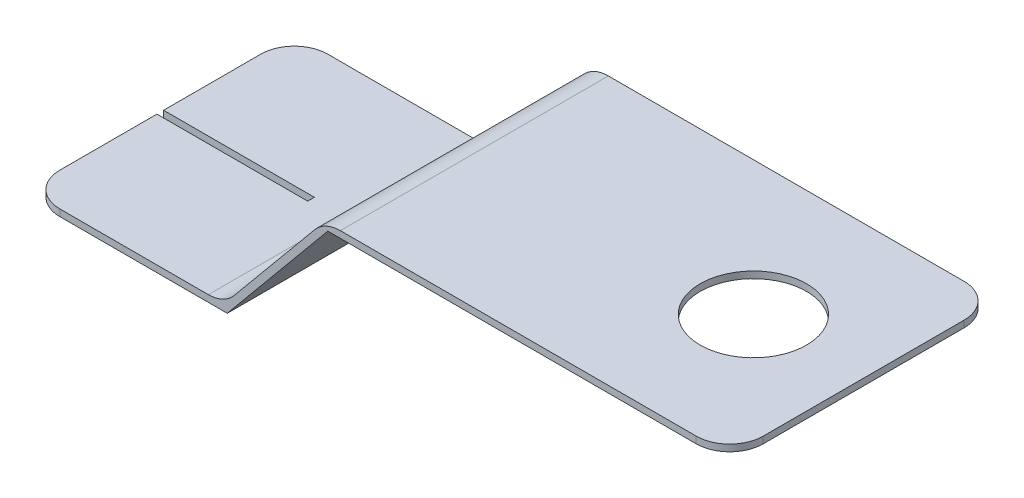
ISO-10303-21;
HEADER;
FILE_DESCRIPTION(('STEP AP214'),'2;1');
FILE_NAME('part.step','',(''),(''),'','','');
FILE_SCHEMA(('AUTOMOTIVE_DESIGN { 1 0 10303 214 1 1 1 1 }'));
ENDSEC;
DATA;
#1=APPLICATION_CONTEXT('core data for automotive mechanical design processes');
#2=APPLICATION_PROTOCOL_DEFINITION('international standard','automotive_design',2000,#1);
#3=PRODUCT_CONTEXT('',#1,'mechanical');
#4=PRODUCT('Part','Part','',(#3));
#5=PRODUCT_RELATED_PRODUCT_CATEGORY('part','',(#4));
#6=PRODUCT_DEFINITION_FORMATION('','',#4);
#7=PRODUCT_DEFINITION_CONTEXT('part definition',#1,'design');
#8=PRODUCT_DEFINITION('design','',#6,#7);
#9=PRODUCT_DEFINITION_SHAPE('','',#8);
#10=(LENGTH_UNIT() NAMED_UNIT(*) SI_UNIT(.MILLI.,.METRE.));
#11=(NAMED_UNIT(*) PLANE_ANGLE_UNIT() SI_UNIT($,.RADIAN.));
#12=(NAMED_UNIT(*) SI_UNIT($,.STERADIAN.) SOLID_ANGLE_UNIT());
#13=UNCERTAINTY_MEASURE_WITH_UNIT(LENGTH_MEASURE(1.E-05),#10,'distance_accuracy_value','');
#14=(GEOMETRIC_REPRESENTATION_CONTEXT(3) GLOBAL_UNCERTAINTY_ASSIGNED_CONTEXT((#13)) GLOBAL_UNIT_ASSIGNED_CONTEXT((#10,
#11,#12)) REPRESENTATION_CONTEXT('',''));
#15=CARTESIAN_POINT('',(0.,0.,0.));
#16=DIRECTION('',(0.,0.,1.));
#17=DIRECTION('',(1.,0.,0.));
#18=AXIS2_PLACEMENT_3D('',#15,#16,#17);
#19=CARTESIAN_POINT('',(0.,0.2,4.));
#20=DIRECTION('',(1.,0.,0.));
#21=DIRECTION('',(0.,0.,-1.));
#22=AXIS2_PLACEMENT_3D('',#19,#20,#21);
#23=PLANE('',#22);
#24=DIRECTION('',(0.,0.,-1.));
#25=VECTOR('',#24,1.);
#26=CARTESIAN_POINT('',(0.,0.,4.));
#27=LINE('',#26,#25);
#28=CARTESIAN_POINT('',(0.,0.,-0.1));
#29=VERTEX_POINT('',#28);
#30=CARTESIAN_POINT('',(0.,0.,-3.));
#31=VERTEX_POINT('',#30);
#32=EDGE_CURVE('E287',#29,#31,#27,.T.);
#33=ORIENTED_EDGE('',*,*,#32,.F.);
#34=DIRECTION('',(0.,1.,0.));
#35=VECTOR('',#34,1.);
#36=CARTESIAN_POINT('',(0.,-9.8,-0.1));
#37=LINE('',#36,#35);
#38=CARTESIAN_POINT('',(0.,0.2,-0.1));
#39=VERTEX_POINT('',#38);
#40=EDGE_CURVE('E202',#29,#39,#37,.T.);
#41=ORIENTED_EDGE('',*,*,#40,.T.);
#42=DIRECTION('',(0.,0.,-1.));
#43=VECTOR('',#42,1.);
#44=CARTESIAN_POINT('',(0.,0.2,4.));
#45=LINE('',#44,#43);
#46=CARTESIAN_POINT('',(0.,0.2,-3.));
#47=VERTEX_POINT('',#46);
#48=EDGE_CURVE('E249',#39,#47,#45,.T.);
#49=ORIENTED_EDGE('',*,*,#48,.T.);
#50=DIRECTION('',(0.,-1.,0.));
#51=VECTOR('',#50,1.);
#52=CARTESIAN_POINT('',(0.,0.2,-3.));
#53=LINE('',#52,#51);
#54=EDGE_CURVE('E329',#47,#31,#53,.T.);
#55=ORIENTED_EDGE('',*,*,#54,.T.);
#56=EDGE_LOOP('',(#33,#41,#49,#55));
#57=FACE_BOUND('',#56,.T.);
#58=ADVANCED_FACE('F42',(#57),#23,.F.);
#59=CARTESIAN_POINT('',(0.,0.2,3.));
#60=VERTEX_POINT('',#59);
#61=CARTESIAN_POINT('',(0.,0.2,0.1));
#62=VERTEX_POINT('',#61);
#63=EDGE_CURVE('E268',#60,#62,#45,.T.);
#64=ORIENTED_EDGE('',*,*,#63,.T.);
#65=DIRECTION('',(0.,1.,0.));
#66=VECTOR('',#65,1.);
#67=CARTESIAN_POINT('',(0.,-9.8,0.1));
#68=LINE('',#67,#66);
#69=CARTESIAN_POINT('',(0.,0.,0.1));
#70=VERTEX_POINT('',#69);
#71=EDGE_CURVE('E182',#70,#62,#68,.T.);
#72=ORIENTED_EDGE('',*,*,#71,.F.);
#73=CARTESIAN_POINT('',(0.,0.,3.));
#74=VERTEX_POINT('',#73);
#75=EDGE_CURVE('E288',#74,#70,#27,.T.);
#76=ORIENTED_EDGE('',*,*,#75,.F.);
#77=DIRECTION('',(0.,-1.,0.));
#78=VECTOR('',#77,1.);
#79=CARTESIAN_POINT('',(0.,0.2,3.));
#80=LINE('',#79,#78);
#81=EDGE_CURVE('E326',#74,#60,#80,.F.);
#82=ORIENTED_EDGE('',*,*,#81,.T.);
#83=EDGE_LOOP('',(#64,#72,#76,#82));
#84=FACE_BOUND('',#83,.T.);
#85=ADVANCED_FACE('F423',(#84),#23,.F.);
#86=CARTESIAN_POINT('',(0.,0.,4.));
#87=DIRECTION('',(0.,1.,0.));
#88=DIRECTION('',(0.,0.,1.));
#89=AXIS2_PLACEMENT_3D('',#86,#87,#88);
#90=PLANE('',#89);
#91=DIRECTION('',(0.,0.,-1.));
#92=VECTOR('',#91,1.);
#93=CARTESIAN_POINT('',(4.5,0.,4.));
#94=LINE('',#93,#92);
#95=CARTESIAN_POINT('',(4.5,0.,0.0999999999999999));
#96=VERTEX_POINT('',#95);
#97=CARTESIAN_POINT('',(4.5,0.,-0.1));
#98=VERTEX_POINT('',#97);
#99=EDGE_CURVE('E177',#96,#98,#94,.T.);
#100=ORIENTED_EDGE('',*,*,#99,.T.);
#101=DIRECTION('',(-1.,0.,0.));
#102=VECTOR('',#101,1.);
#103=CARTESIAN_POINT('',(0.,0.,-0.1));
#104=LINE('',#103,#102);
#105=EDGE_CURVE('E215',#98,#29,#104,.T.);
#106=ORIENTED_EDGE('',*,*,#105,.T.);
#107=ORIENTED_EDGE('',*,*,#32,.T.);
#108=CARTESIAN_POINT('',(1.,0.,-3.));
#109=DIRECTION('',(0.,1.,0.));
#110=DIRECTION('',(0.,0.,1.));
#111=AXIS2_PLACEMENT_3D('',#108,#109,#110);
#112=CIRCLE('',#111,1.);
#113=CARTESIAN_POINT('',(1.,0.,-4.));
#114=VERTEX_POINT('',#113);
#115=EDGE_CURVE('E336',#31,#114,#112,.F.);
#116=ORIENTED_EDGE('',*,*,#115,.T.);
#117=DIRECTION('',(1.,0.,0.));
#118=VECTOR('',#117,1.);
#119=CARTESIAN_POINT('',(0.,0.,-4.));
#120=LINE('',#119,#118);
#121=CARTESIAN_POINT('',(6.,0.,-4.));
#122=VERTEX_POINT('',#121);
#123=EDGE_CURVE('E227',#114,#122,#120,.T.);
#124=ORIENTED_EDGE('',*,*,#123,.T.);
#125=DIRECTION('',(0.,0.,-1.));
#126=VECTOR('',#125,1.);
#127=CARTESIAN_POINT('',(6.,0.,4.));
#128=LINE('',#127,#126);
#129=CARTESIAN_POINT('',(6.,0.,4.));
#130=VERTEX_POINT('',#129);
#131=EDGE_CURVE('E283',#130,#122,#128,.T.);
#132=ORIENTED_EDGE('',*,*,#131,.F.);
#133=DIRECTION('',(1.,0.,0.));
#134=VECTOR('',#133,1.);
#135=CARTESIAN_POINT('',(0.,0.,4.));
#136=LINE('',#135,#134);
#137=CARTESIAN_POINT('',(1.,0.,4.));
#138=VERTEX_POINT('',#137);
#139=EDGE_CURVE('E228',#138,#130,#136,.T.);
#140=ORIENTED_EDGE('',*,*,#139,.F.);
#141=CARTESIAN_POINT('',(1.,0.,3.));
#142=DIRECTION('',(0.,1.,0.));
#143=DIRECTION('',(0.,0.,1.));
#144=AXIS2_PLACEMENT_3D('',#141,#142,#143);
#145=CIRCLE('',#144,1.);
#146=EDGE_CURVE('E333',#138,#74,#145,.F.);
#147=ORIENTED_EDGE('',*,*,#146,.T.);
#148=ORIENTED_EDGE('',*,*,#75,.T.);
#149=DIRECTION('',(1.,0.,0.));
#150=VECTOR('',#149,1.);
#151=CARTESIAN_POINT('',(0.,0.,0.1));
#152=LINE('',#151,#150);
#153=EDGE_CURVE('E206',#70,#96,#152,.T.);
#154=ORIENTED_EDGE('',*,*,#153,.T.);
#155=EDGE_LOOP('',(#100,#106,#107,#116,#124,#132,#140,#147,#148,#154));
#156=FACE_BOUND('',#155,.T.);
#157=ADVANCED_FACE('F386',(#156),#90,.F.);
#158=CARTESIAN_POINT('',(6.,0.,4.));
#159=DIRECTION('',(-0.77039432112469,0.637567714034226,0.));
#160=DIRECTION('',(-0.637567714034226,-0.77039432112469,0.));
#161=AXIS2_PLACEMENT_3D('',#158,#159,#160);
#162=PLANE('',#161);
#163=DIRECTION('',(0.637567714034226,0.77039432112469,0.));
#164=VECTOR('',#163,1.);
#165=CARTESIAN_POINT('',(6.,0.,-4.));
#166=LINE('',#165,#164);
#167=CARTESIAN_POINT('',(9.,3.625,-4.));
#168=VERTEX_POINT('',#167);
#169=EDGE_CURVE('E252',#122,#168,#166,.T.);
#170=ORIENTED_EDGE('',*,*,#169,.T.);
#171=DIRECTION('',(0.,0.,-1.));
#172=VECTOR('',#171,1.);
#173=CARTESIAN_POINT('',(9.,3.625,4.));
#174=LINE('',#173,#172);
#175=CARTESIAN_POINT('',(9.,3.625,4.));
#176=VERTEX_POINT('',#175);
#177=EDGE_CURVE('E279',#176,#168,#174,.T.);
#178=ORIENTED_EDGE('',*,*,#177,.F.);
#179=DIRECTION('',(0.637567714034226,0.77039432112469,0.));
#180=VECTOR('',#179,1.);
#181=CARTESIAN_POINT('',(6.,0.,4.));
#182=LINE('',#181,#180);
#183=EDGE_CURVE('E231',#130,#176,#182,.T.);
#184=ORIENTED_EDGE('',*,*,#183,.F.);
#185=ORIENTED_EDGE('',*,*,#131,.T.);
#186=EDGE_LOOP('',(#170,#178,#184,#185));
#187=FACE_BOUND('',#186,.T.);
#188=ADVANCED_FACE('F393',(#187),#162,.F.);
#189=CARTESIAN_POINT('',(9.,3.625,4.));
#190=DIRECTION('',(0.,1.,0.));
#191=DIRECTION('',(-1.,0.,0.));
#192=AXIS2_PLACEMENT_3D('',#189,#190,#191);
#193=PLANE('',#192);
#194=CARTESIAN_POINT('',(17.7059099279349,3.625,0.));
#195=DIRECTION('',(0.,1.,0.));
#196=DIRECTION('',(-1.,0.,0.));
#197=AXIS2_PLACEMENT_3D('',#194,#195,#196);
#198=CIRCLE('',#197,1.5875);
#199=CARTESIAN_POINT('',(16.1184099279349,3.625,0.));
#200=VERTEX_POINT('',#199);
#201=EDGE_CURVE('E223',#200,#200,#198,.T.);
#202=ORIENTED_EDGE('',*,*,#201,.T.);
#203=EDGE_LOOP('',(#202));
#204=FACE_BOUND('',#203,.T.);
#205=DIRECTION('',(1.,0.,0.));
#206=VECTOR('',#205,1.);
#207=CARTESIAN_POINT('',(9.,3.625,-4.));
#208=LINE('',#207,#206);
#209=CARTESIAN_POINT('',(20.,3.625,-4.));
#210=VERTEX_POINT('',#209);
#211=EDGE_CURVE('E255',#168,#210,#208,.T.);
#212=ORIENTED_EDGE('',*,*,#211,.T.);
#213=CARTESIAN_POINT('',(20.,3.625,-3.));
#214=DIRECTION('',(0.,1.,0.));
#215=DIRECTION('',(-1.,0.,0.));
#216=AXIS2_PLACEMENT_3D('',#213,#214,#215);
#217=CIRCLE('',#216,1.);
#218=CARTESIAN_POINT('',(21.,3.625,-3.));
#219=VERTEX_POINT('',#218);
#220=EDGE_CURVE('E315',#210,#219,#217,.F.);
#221=ORIENTED_EDGE('',*,*,#220,.T.);
#222=DIRECTION('',(0.,0.,-1.));
#223=VECTOR('',#222,1.);
#224=CARTESIAN_POINT('',(21.,3.625,4.));
#225=LINE('',#224,#223);
#226=CARTESIAN_POINT('',(21.,3.625,3.));
#227=VERTEX_POINT('',#226);
#228=EDGE_CURVE('E275',#227,#219,#225,.T.);
#229=ORIENTED_EDGE('',*,*,#228,.F.);
#230=CARTESIAN_POINT('',(20.,3.625,3.));
#231=DIRECTION('',(0.,1.,0.));
#232=DIRECTION('',(-1.,0.,0.));
#233=AXIS2_PLACEMENT_3D('',#230,#231,#232);
#234=CIRCLE('',#233,1.);
#235=CARTESIAN_POINT('',(20.,3.625,4.));
#236=VERTEX_POINT('',#235);
#237=EDGE_CURVE('E312',#227,#236,#234,.F.);
#238=ORIENTED_EDGE('',*,*,#237,.T.);
#239=DIRECTION('',(1.,0.,0.));
#240=VECTOR('',#239,1.);
#241=CARTESIAN_POINT('',(9.,3.625,4.));
#242=LINE('',#241,#240);
#243=EDGE_CURVE('E235',#176,#236,#242,.T.);
#244=ORIENTED_EDGE('',*,*,#243,.F.);
#245=ORIENTED_EDGE('',*,*,#177,.T.);
#246=EDGE_LOOP('',(#212,#221,#229,#238,#244,#245));
#247=FACE_BOUND('',#246,.T.);
#248=ADVANCED_FACE('F412',(#204,#247),#193,.F.);
#249=CARTESIAN_POINT('',(21.,3.825,4.));
#250=DIRECTION('',(-1.,0.,0.));
#251=DIRECTION('',(0.,0.,1.));
#252=AXIS2_PLACEMENT_3D('',#249,#250,#251);
#253=PLANE('',#252);
#254=ORIENTED_EDGE('',*,*,#228,.T.);
#255=DIRECTION('',(0.,1.,0.));
#256=VECTOR('',#255,1.);
#257=CARTESIAN_POINT('',(21.,3.825,-3.));
#258=LINE('',#257,#256);
#259=CARTESIAN_POINT('',(21.,3.825,-3.));
#260=VERTEX_POINT('',#259);
#261=EDGE_CURVE('E295',#219,#260,#258,.T.);
#262=ORIENTED_EDGE('',*,*,#261,.T.);
#263=DIRECTION('',(0.,0.,-1.));
#264=VECTOR('',#263,1.);
#265=CARTESIAN_POINT('',(21.,3.825,4.));
#266=LINE('',#265,#264);
#267=CARTESIAN_POINT('',(21.,3.825,3.));
#268=VERTEX_POINT('',#267);
#269=EDGE_CURVE('E271',#268,#260,#266,.T.);
#270=ORIENTED_EDGE('',*,*,#269,.F.);
#271=DIRECTION('',(0.,1.,0.));
#272=VECTOR('',#271,1.);
#273=CARTESIAN_POINT('',(21.,3.625,3.));
#274=LINE('',#273,#272);
#275=EDGE_CURVE('E292',#268,#227,#274,.F.);
#276=ORIENTED_EDGE('',*,*,#275,.T.);
#277=EDGE_LOOP('',(#254,#262,#270,#276));
#278=FACE_BOUND('',#277,.T.);
#279=ADVANCED_FACE('F404',(#278),#253,.F.);
#280=CARTESIAN_POINT('',(8.90590992793492,3.825,4.));
#281=DIRECTION('',(0.,-1.,0.));
#282=DIRECTION('',(0.,0.,-1.));
#283=AXIS2_PLACEMENT_3D('',#280,#281,#282);
#284=PLANE('',#283);
#285=CARTESIAN_POINT('',(17.7059099279349,3.825,0.));
#286=DIRECTION('',(0.,1.,0.));
#287=DIRECTION('',(0.,0.,1.));
#288=AXIS2_PLACEMENT_3D('',#285,#286,#287);
#289=CIRCLE('',#288,1.5875);
#290=CARTESIAN_POINT('',(17.7059099279349,3.825,1.5875));
#291=VERTEX_POINT('',#290);
#292=EDGE_CURVE('E219',#291,#291,#289,.T.);
#293=ORIENTED_EDGE('',*,*,#292,.F.);
#294=EDGE_LOOP('',(#293));
#295=FACE_BOUND('',#294,.T.);
#296=DIRECTION('',(-1.,0.,0.));
#297=VECTOR('',#296,1.);
#298=CARTESIAN_POINT('',(8.90590992793492,3.825,-4.));
#299=LINE('',#298,#297);
#300=CARTESIAN_POINT('',(20.,3.825,-4.));
#301=VERTEX_POINT('',#300);
#302=CARTESIAN_POINT('',(9.37636028826035,3.825,-4.));
#303=VERTEX_POINT('',#302);
#304=EDGE_CURVE('E259',#301,#303,#299,.T.);
#305=ORIENTED_EDGE('',*,*,#304,.T.);
#306=DIRECTION('',(0.,0.,-1.));
#307=VECTOR('',#306,1.);
#308=CARTESIAN_POINT('',(9.37636028826035,3.825,4.));
#309=LINE('',#308,#307);
#310=CARTESIAN_POINT('',(9.37636028826035,3.825,4.));
#311=VERTEX_POINT('',#310);
#312=EDGE_CURVE('E58',#303,#311,#309,.F.);
#313=ORIENTED_EDGE('',*,*,#312,.T.);
#314=DIRECTION('',(-1.,0.,0.));
#315=VECTOR('',#314,1.);
#316=CARTESIAN_POINT('',(8.90590992793492,3.825,4.));
#317=LINE('',#316,#315);
#318=CARTESIAN_POINT('',(20.,3.825,4.));
#319=VERTEX_POINT('',#318);
#320=EDGE_CURVE('E239',#319,#311,#317,.T.);
#321=ORIENTED_EDGE('',*,*,#320,.F.);
#322=CARTESIAN_POINT('',(20.,3.825,3.));
#323=DIRECTION('',(0.,-1.,0.));
#324=DIRECTION('',(0.,0.,-1.));
#325=AXIS2_PLACEMENT_3D('',#322,#323,#324);
#326=CIRCLE('',#325,1.);
#327=EDGE_CURVE('E299',#319,#268,#326,.F.);
#328=ORIENTED_EDGE('',*,*,#327,.T.);
#329=ORIENTED_EDGE('',*,*,#269,.T.);
#330=CARTESIAN_POINT('',(20.,3.825,-3.));
#331=DIRECTION('',(0.,-1.,0.));
#332=DIRECTION('',(0.,0.,-1.));
#333=AXIS2_PLACEMENT_3D('',#330,#331,#332);
#334=CIRCLE('',#333,1.);
#335=EDGE_CURVE('E302',#260,#301,#334,.F.);
#336=ORIENTED_EDGE('',*,*,#335,.T.);
#337=EDGE_LOOP('',(#305,#313,#321,#328,#329,#336));
#338=FACE_BOUND('',#337,.T.);
#339=ADVANCED_FACE('F402',(#295,#338),#284,.F.);
#340=CARTESIAN_POINT('',(5.90590992793492,0.2,4.));
#341=DIRECTION('',(0.770394321124689,-0.637567714034226,0.));
#342=DIRECTION('',(0.637567714034226,0.770394321124689,0.));
#343=AXIS2_PLACEMENT_3D('',#340,#341,#342);
#344=PLANE('',#343);
#345=DIRECTION('',(-0.637567714034226,-0.770394321124689,0.));
#346=VECTOR('',#345,1.);
#347=CARTESIAN_POINT('',(5.90590992793492,0.2,-4.));
#348=LINE('',#347,#346);
#349=CARTESIAN_POINT('',(8.60596596713566,3.46256771403423,-4.));
#350=VERTEX_POINT('',#349);
#351=CARTESIAN_POINT('',(6.20585388873418,0.562432285965774,-4.));
#352=VERTEX_POINT('',#351);
#353=EDGE_CURVE('E262',#350,#352,#348,.T.);
#354=ORIENTED_EDGE('',*,*,#353,.T.);
#355=DIRECTION('',(0.,0.,-1.));
#356=VECTOR('',#355,1.);
#357=CARTESIAN_POINT('',(6.20585388873418,0.562432285965774,4.));
#358=LINE('',#357,#356);
#359=CARTESIAN_POINT('',(6.20585388873418,0.562432285965774,4.));
#360=VERTEX_POINT('',#359);
#361=EDGE_CURVE('E355',#352,#360,#358,.F.);
#362=ORIENTED_EDGE('',*,*,#361,.T.);
#363=DIRECTION('',(-0.637567714034226,-0.770394321124689,0.));
#364=VECTOR('',#363,1.);
#365=CARTESIAN_POINT('',(5.90590992793492,0.2,4.));
#366=LINE('',#365,#364);
#367=CARTESIAN_POINT('',(8.60596596713566,3.46256771403423,4.));
#368=VERTEX_POINT('',#367);
#369=EDGE_CURVE('E242',#368,#360,#366,.T.);
#370=ORIENTED_EDGE('',*,*,#369,.F.);
#371=DIRECTION('',(0.,0.,-1.));
#372=VECTOR('',#371,1.);
#373=CARTESIAN_POINT('',(8.60596596713566,3.46256771403423,4.));
#374=LINE('',#373,#372);
#375=EDGE_CURVE('E351',#368,#350,#374,.T.);
#376=ORIENTED_EDGE('',*,*,#375,.T.);
#377=EDGE_LOOP('',(#354,#362,#370,#376));
#378=FACE_BOUND('',#377,.T.);
#379=ADVANCED_FACE('F371',(#378),#344,.F.);
#380=CARTESIAN_POINT('',(0.,0.2,4.));
#381=DIRECTION('',(0.,-1.,0.));
#382=DIRECTION('',(1.,0.,0.));
#383=AXIS2_PLACEMENT_3D('',#380,#381,#382);
#384=PLANE('',#383);
#385=DIRECTION('',(-1.,0.,0.));
#386=VECTOR('',#385,1.);
#387=CARTESIAN_POINT('',(0.,0.2,4.));
#388=LINE('',#387,#386);
#389=CARTESIAN_POINT('',(5.43545956760949,0.2,4.));
#390=VERTEX_POINT('',#389);
#391=CARTESIAN_POINT('',(1.,0.2,4.));
#392=VERTEX_POINT('',#391);
#393=EDGE_CURVE('E246',#390,#392,#388,.T.);
#394=ORIENTED_EDGE('',*,*,#393,.F.);
#395=DIRECTION('',(0.,0.,-1.));
#396=VECTOR('',#395,1.);
#397=CARTESIAN_POINT('',(5.43545956760949,0.2,-4.));
#398=LINE('',#397,#396);
#399=CARTESIAN_POINT('',(5.43545956760949,0.2,-4.));
#400=VERTEX_POINT('',#399);
#401=EDGE_CURVE('E347',#390,#400,#398,.T.);
#402=ORIENTED_EDGE('',*,*,#401,.T.);
#403=DIRECTION('',(-1.,0.,0.));
#404=VECTOR('',#403,1.);
#405=CARTESIAN_POINT('',(0.,0.2,-4.));
#406=LINE('',#405,#404);
#407=CARTESIAN_POINT('',(1.,0.2,-4.));
#408=VERTEX_POINT('',#407);
#409=EDGE_CURVE('E232',#400,#408,#406,.T.);
#410=ORIENTED_EDGE('',*,*,#409,.T.);
#411=CARTESIAN_POINT('',(1.,0.2,-3.));
#412=DIRECTION('',(0.,-1.,0.));
#413=DIRECTION('',(1.,0.,0.));
#414=AXIS2_PLACEMENT_3D('',#411,#412,#413);
#415=CIRCLE('',#414,1.);
#416=EDGE_CURVE('E343',#408,#47,#415,.F.);
#417=ORIENTED_EDGE('',*,*,#416,.T.);
#418=ORIENTED_EDGE('',*,*,#48,.F.);
#419=DIRECTION('',(-1.,0.,0.));
#420=VECTOR('',#419,1.);
#421=CARTESIAN_POINT('',(0.,0.2,-0.1));
#422=LINE('',#421,#420);
#423=CARTESIAN_POINT('',(4.5,0.2,-0.1));
#424=VERTEX_POINT('',#423);
#425=EDGE_CURVE('E196',#424,#39,#422,.T.);
#426=ORIENTED_EDGE('',*,*,#425,.F.);
#427=DIRECTION('',(0.,0.,-1.));
#428=VECTOR('',#427,1.);
#429=CARTESIAN_POINT('',(4.5,0.2,-0.1));
#430=LINE('',#429,#428);
#431=CARTESIAN_POINT('',(4.5,0.2,0.0999999999999999));
#432=VERTEX_POINT('',#431);
#433=EDGE_CURVE('E174',#432,#424,#430,.T.);
#434=ORIENTED_EDGE('',*,*,#433,.F.);
#435=DIRECTION('',(1.,0.,0.));
#436=VECTOR('',#435,1.);
#437=CARTESIAN_POINT('',(0.,0.2,0.1));
#438=LINE('',#437,#436);
#439=EDGE_CURVE('E185',#62,#432,#438,.T.);
#440=ORIENTED_EDGE('',*,*,#439,.F.);
#441=ORIENTED_EDGE('',*,*,#63,.F.);
#442=CARTESIAN_POINT('',(1.,0.2,3.));
#443=DIRECTION('',(0.,-1.,0.));
#444=DIRECTION('',(1.,0.,0.));
#445=AXIS2_PLACEMENT_3D('',#442,#443,#444);
#446=CIRCLE('',#445,1.);
#447=EDGE_CURVE('E339',#60,#392,#446,.F.);
#448=ORIENTED_EDGE('',*,*,#447,.T.);
#449=EDGE_LOOP('',(#394,#402,#410,#417,#418,#426,#434,#440,#441,#448));
#450=FACE_BOUND('',#449,.T.);
#451=ADVANCED_FACE('F194',(#450),#384,.F.);
#452=CARTESIAN_POINT('',(0.,0.,4.));
#453=DIRECTION('',(0.,0.,1.));
#454=DIRECTION('',(1.,0.,0.));
#455=AXIS2_PLACEMENT_3D('',#452,#453,#454);
#456=PLANE('',#455);
#457=ORIENTED_EDGE('',*,*,#320,.T.);
#458=CARTESIAN_POINT('',(9.37636028826035,2.825,4.));
#459=DIRECTION('',(0.,0.,1.));
#460=DIRECTION('',(1.,0.,0.));
#461=AXIS2_PLACEMENT_3D('',#458,#459,#460);
#462=CIRCLE('',#461,1.);
#463=EDGE_CURVE('E362',#311,#368,#462,.T.);
#464=ORIENTED_EDGE('',*,*,#463,.T.);
#465=ORIENTED_EDGE('',*,*,#369,.T.);
#466=CARTESIAN_POINT('',(5.43545956760949,1.2,4.));
#467=DIRECTION('',(0.,0.,1.));
#468=DIRECTION('',(1.,0.,0.));
#469=AXIS2_PLACEMENT_3D('',#466,#467,#468);
#470=CIRCLE('',#469,1.);
#471=EDGE_CURVE('E11',#360,#390,#470,.F.);
#472=ORIENTED_EDGE('',*,*,#471,.T.);
#473=ORIENTED_EDGE('',*,*,#393,.T.);
#474=DIRECTION('',(0.,-1.,0.));
#475=VECTOR('',#474,1.);
#476=CARTESIAN_POINT('',(1.,0.,4.));
#477=LINE('',#476,#475);
#478=EDGE_CURVE('E318',#392,#138,#477,.T.);
#479=ORIENTED_EDGE('',*,*,#478,.T.);
#480=ORIENTED_EDGE('',*,*,#139,.T.);
#481=ORIENTED_EDGE('',*,*,#183,.T.);
#482=ORIENTED_EDGE('',*,*,#243,.T.);
#483=DIRECTION('',(0.,1.,0.));
#484=VECTOR('',#483,1.);
#485=CARTESIAN_POINT('',(20.,3.825,4.));
#486=LINE('',#485,#484);
#487=EDGE_CURVE('E322',#236,#319,#486,.T.);
#488=ORIENTED_EDGE('',*,*,#487,.T.);
#489=EDGE_LOOP('',(#457,#464,#465,#472,#473,#479,#480,#481,#482,#488));
#490=FACE_BOUND('',#489,.T.);
#491=ADVANCED_FACE('F377',(#490),#456,.T.);
#492=CARTESIAN_POINT('',(0.,0.,-4.));
#493=DIRECTION('',(0.,0.,1.));
#494=DIRECTION('',(1.,0.,0.));
#495=AXIS2_PLACEMENT_3D('',#492,#493,#494);
#496=PLANE('',#495);
#497=ORIENTED_EDGE('',*,*,#353,.F.);
#498=CARTESIAN_POINT('',(9.37636028826035,2.825,-4.));
#499=DIRECTION('',(0.,0.,1.));
#500=DIRECTION('',(1.,0.,0.));
#501=AXIS2_PLACEMENT_3D('',#498,#499,#500);
#502=CIRCLE('',#501,1.);
#503=EDGE_CURVE('E66',#350,#303,#502,.F.);
#504=ORIENTED_EDGE('',*,*,#503,.T.);
#505=ORIENTED_EDGE('',*,*,#304,.F.);
#506=DIRECTION('',(0.,1.,0.));
#507=VECTOR('',#506,1.);
#508=CARTESIAN_POINT('',(20.,0.,-4.));
#509=LINE('',#508,#507);
#510=EDGE_CURVE('E309',#301,#210,#509,.F.);
#511=ORIENTED_EDGE('',*,*,#510,.T.);
#512=ORIENTED_EDGE('',*,*,#211,.F.);
#513=ORIENTED_EDGE('',*,*,#169,.F.);
#514=ORIENTED_EDGE('',*,*,#123,.F.);
#515=DIRECTION('',(0.,-1.,0.));
#516=VECTOR('',#515,1.);
#517=CARTESIAN_POINT('',(1.,0.,-4.));
#518=LINE('',#517,#516);
#519=EDGE_CURVE('E305',#114,#408,#518,.F.);
#520=ORIENTED_EDGE('',*,*,#519,.T.);
#521=ORIENTED_EDGE('',*,*,#409,.F.);
#522=CARTESIAN_POINT('',(5.43545956760949,1.2,-4.));
#523=DIRECTION('',(0.,0.,1.));
#524=DIRECTION('',(1.,0.,0.));
#525=AXIS2_PLACEMENT_3D('',#522,#523,#524);
#526=CIRCLE('',#525,1.);
#527=EDGE_CURVE('E51',#400,#352,#526,.T.);
#528=ORIENTED_EDGE('',*,*,#527,.T.);
#529=EDGE_LOOP('',(#497,#504,#505,#511,#512,#513,#514,#520,#521,#528));
#530=FACE_BOUND('',#529,.T.);
#531=ADVANCED_FACE('F366',(#530),#496,.F.);
#532=CARTESIAN_POINT('',(17.7059099279349,-6.175,0.));
#533=DIRECTION('',(0.,1.,0.));
#534=DIRECTION('',(0.,0.,1.));
#535=AXIS2_PLACEMENT_3D('',#532,#533,#534);
#536=CYLINDRICAL_SURFACE('',#535,1.5875);
#537=ORIENTED_EDGE('',*,*,#292,.T.);
#538=EDGE_LOOP('',(#537));
#539=FACE_BOUND('',#538,.T.);
#540=ORIENTED_EDGE('',*,*,#201,.F.);
#541=EDGE_LOOP('',(#540));
#542=FACE_BOUND('',#541,.T.);
#543=ADVANCED_FACE('F435',(#539,#542),#536,.F.);
#544=CARTESIAN_POINT('',(20.,3.825,-3.));
#545=DIRECTION('',(0.,1.,0.));
#546=DIRECTION('',(0.,0.,1.));
#547=AXIS2_PLACEMENT_3D('',#544,#545,#546);
#548=CYLINDRICAL_SURFACE('',#547,1.);
#549=ORIENTED_EDGE('',*,*,#220,.F.);
#550=ORIENTED_EDGE('',*,*,#510,.F.);
#551=ORIENTED_EDGE('',*,*,#335,.F.);
#552=ORIENTED_EDGE('',*,*,#261,.F.);
#553=EDGE_LOOP('',(#549,#550,#551,#552));
#554=FACE_BOUND('',#553,.T.);
#555=ADVANCED_FACE('F409',(#554),#548,.T.);
#556=CARTESIAN_POINT('',(20.,0.,3.));
#557=DIRECTION('',(0.,-1.,0.));
#558=DIRECTION('',(0.,0.,-1.));
#559=AXIS2_PLACEMENT_3D('',#556,#557,#558);
#560=CYLINDRICAL_SURFACE('',#559,1.);
#561=ORIENTED_EDGE('',*,*,#237,.F.);
#562=ORIENTED_EDGE('',*,*,#275,.F.);
#563=ORIENTED_EDGE('',*,*,#327,.F.);
#564=ORIENTED_EDGE('',*,*,#487,.F.);
#565=EDGE_LOOP('',(#561,#562,#563,#564));
#566=FACE_BOUND('',#565,.T.);
#567=ADVANCED_FACE('F399',(#566),#560,.T.);
#568=CARTESIAN_POINT('',(1.,0.2,-3.));
#569=DIRECTION('',(0.,-1.,0.));
#570=DIRECTION('',(0.,0.,-1.));
#571=AXIS2_PLACEMENT_3D('',#568,#569,#570);
#572=CYLINDRICAL_SURFACE('',#571,1.);
#573=ORIENTED_EDGE('',*,*,#416,.F.);
#574=ORIENTED_EDGE('',*,*,#519,.F.);
#575=ORIENTED_EDGE('',*,*,#115,.F.);
#576=ORIENTED_EDGE('',*,*,#54,.F.);
#577=EDGE_LOOP('',(#573,#574,#575,#576));
#578=FACE_BOUND('',#577,.T.);
#579=ADVANCED_FACE('F438',(#578),#572,.T.);
#580=CARTESIAN_POINT('',(1.,0.,3.));
#581=DIRECTION('',(0.,1.,0.));
#582=DIRECTION('',(0.,0.,1.));
#583=AXIS2_PLACEMENT_3D('',#580,#581,#582);
#584=CYLINDRICAL_SURFACE('',#583,1.);
#585=ORIENTED_EDGE('',*,*,#447,.F.);
#586=ORIENTED_EDGE('',*,*,#81,.F.);
#587=ORIENTED_EDGE('',*,*,#146,.F.);
#588=ORIENTED_EDGE('',*,*,#478,.F.);
#589=EDGE_LOOP('',(#585,#586,#587,#588));
#590=FACE_BOUND('',#589,.T.);
#591=ADVANCED_FACE('F382',(#590),#584,.T.);
#592=CARTESIAN_POINT('',(0.,-9.8,-0.1));
#593=DIRECTION('',(0.,0.,-1.));
#594=DIRECTION('',(-1.,0.,0.));
#595=AXIS2_PLACEMENT_3D('',#592,#593,#594);
#596=PLANE('',#595);
#597=DIRECTION('',(0.,1.,0.));
#598=VECTOR('',#597,1.);
#599=CARTESIAN_POINT('',(4.5,-9.8,-0.1));
#600=LINE('',#599,#598);
#601=EDGE_CURVE('E181',#98,#424,#600,.T.);
#602=ORIENTED_EDGE('',*,*,#601,.T.);
#603=ORIENTED_EDGE('',*,*,#425,.T.);
#604=ORIENTED_EDGE('',*,*,#40,.F.);
#605=ORIENTED_EDGE('',*,*,#105,.F.);
#606=EDGE_LOOP('',(#602,#603,#604,#605));
#607=FACE_BOUND('',#606,.T.);
#608=ADVANCED_FACE('F443',(#607),#596,.F.);
#609=CARTESIAN_POINT('',(4.5,-9.8,-0.1));
#610=DIRECTION('',(1.,0.,0.));
#611=DIRECTION('',(0.,1.,0.));
#612=AXIS2_PLACEMENT_3D('',#609,#610,#611);
#613=PLANE('',#612);
#614=DIRECTION('',(0.,1.,0.));
#615=VECTOR('',#614,1.);
#616=CARTESIAN_POINT('',(4.5,-9.8,0.0999999999999999));
#617=LINE('',#616,#615);
#618=EDGE_CURVE('E169',#96,#432,#617,.T.);
#619=ORIENTED_EDGE('',*,*,#618,.T.);
#620=ORIENTED_EDGE('',*,*,#433,.T.);
#621=ORIENTED_EDGE('',*,*,#601,.F.);
#622=ORIENTED_EDGE('',*,*,#99,.F.);
#623=EDGE_LOOP('',(#619,#620,#621,#622));
#624=FACE_BOUND('',#623,.T.);
#625=ADVANCED_FACE('F171',(#624),#613,.F.);
#626=CARTESIAN_POINT('',(0.,-9.8,0.1));
#627=DIRECTION('',(0.,0.,1.));
#628=DIRECTION('',(1.,0.,0.));
#629=AXIS2_PLACEMENT_3D('',#626,#627,#628);
#630=PLANE('',#629);
#631=ORIENTED_EDGE('',*,*,#71,.T.);
#632=ORIENTED_EDGE('',*,*,#439,.T.);
#633=ORIENTED_EDGE('',*,*,#618,.F.);
#634=ORIENTED_EDGE('',*,*,#153,.F.);
#635=EDGE_LOOP('',(#631,#632,#633,#634));
#636=FACE_BOUND('',#635,.T.);
#637=ADVANCED_FACE('F186',(#636),#630,.F.);
#638=CARTESIAN_POINT('',(5.43545956760949,1.2,4.));
#639=DIRECTION('',(0.,0.,1.));
#640=DIRECTION('',(1.,0.,0.));
#641=AXIS2_PLACEMENT_3D('',#638,#639,#640);
#642=CYLINDRICAL_SURFACE('',#641,1.);
#643=ORIENTED_EDGE('',*,*,#471,.F.);
#644=ORIENTED_EDGE('',*,*,#361,.F.);
#645=ORIENTED_EDGE('',*,*,#527,.F.);
#646=ORIENTED_EDGE('',*,*,#401,.F.);
#647=EDGE_LOOP('',(#643,#644,#645,#646));
#648=FACE_BOUND('',#647,.T.);
#649=ADVANCED_FACE('F375',(#648),#642,.F.);
#650=CARTESIAN_POINT('',(9.37636028826035,2.825,4.));
#651=DIRECTION('',(0.,0.,-1.));
#652=DIRECTION('',(-1.,0.,0.));
#653=AXIS2_PLACEMENT_3D('',#650,#651,#652);
#654=CYLINDRICAL_SURFACE('',#653,1.);
#655=ORIENTED_EDGE('',*,*,#463,.F.);
#656=ORIENTED_EDGE('',*,*,#312,.F.);
#657=ORIENTED_EDGE('',*,*,#503,.F.);
#658=ORIENTED_EDGE('',*,*,#375,.F.);
#659=EDGE_LOOP('',(#655,#656,#657,#658));
#660=FACE_BOUND('',#659,.T.);
#661=ADVANCED_FACE('F44',(#660),#654,.T.);
#662=CLOSED_SHELL('',(#58,#85,#157,#188,#248,#279,#339,#379,#451,#491,#531,#543,#555,#567,#579,
#591,#608,#625,#637,#649,#661));
#663=MANIFOLD_SOLID_BREP('B2',#662);
#664=ADVANCED_BREP_SHAPE_REPRESENTATION('',(#18,#663),#14);
#665=SHAPE_DEFINITION_REPRESENTATION(#9,#664);
ENDSEC;
END-ISO-10303-21;
